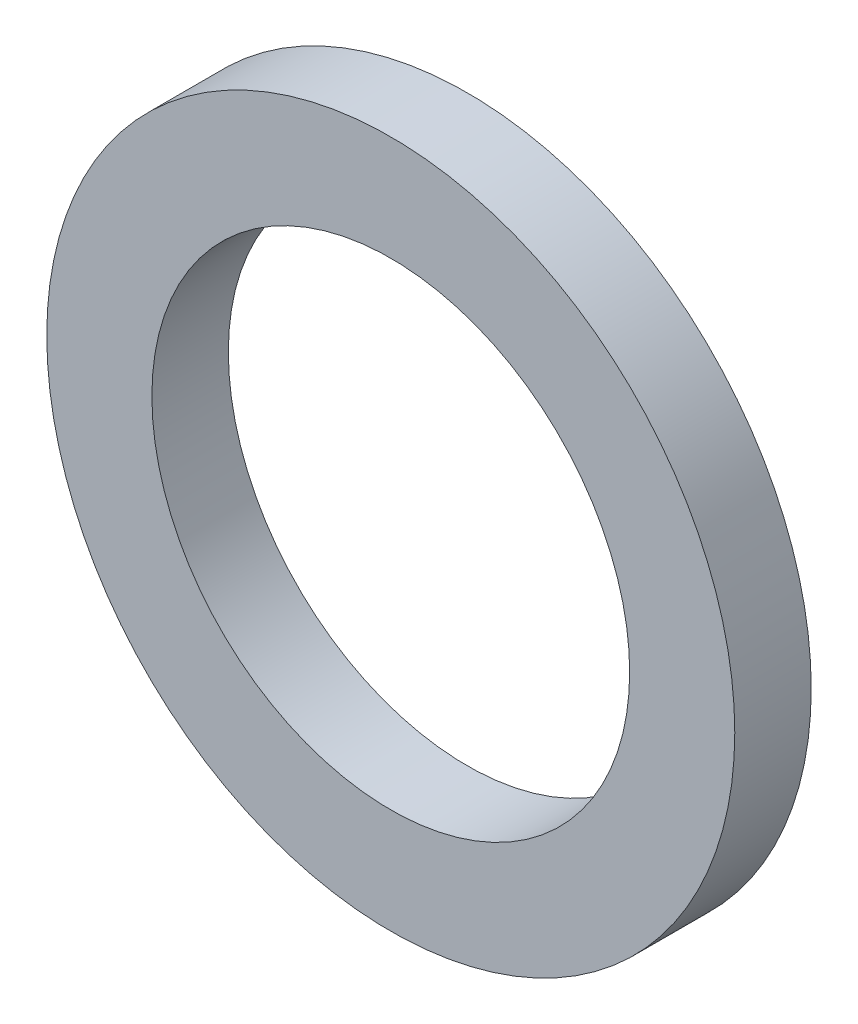
ISO-10303-21;
HEADER;
FILE_DESCRIPTION(('STEP AP214'),'2;1');
FILE_NAME('part.step','',(''),(''),'','','');
FILE_SCHEMA(('AUTOMOTIVE_DESIGN { 1 0 10303 214 1 1 1 1 }'));
ENDSEC;
DATA;
#1=APPLICATION_CONTEXT('core data for automotive mechanical design processes');
#2=APPLICATION_PROTOCOL_DEFINITION('international standard','automotive_design',2000,#1);
#3=PRODUCT_CONTEXT('',#1,'mechanical');
#4=PRODUCT('Part','Part','',(#3));
#5=PRODUCT_RELATED_PRODUCT_CATEGORY('part','',(#4));
#6=PRODUCT_DEFINITION_FORMATION('','',#4);
#7=PRODUCT_DEFINITION_CONTEXT('part definition',#1,'design');
#8=PRODUCT_DEFINITION('design','',#6,#7);
#9=PRODUCT_DEFINITION_SHAPE('','',#8);
#10=(LENGTH_UNIT() NAMED_UNIT(*) SI_UNIT(.MILLI.,.METRE.));
#11=(NAMED_UNIT(*) PLANE_ANGLE_UNIT() SI_UNIT($,.RADIAN.));
#12=(NAMED_UNIT(*) SI_UNIT($,.STERADIAN.) SOLID_ANGLE_UNIT());
#13=UNCERTAINTY_MEASURE_WITH_UNIT(LENGTH_MEASURE(1.E-05),#10,'distance_accuracy_value','');
#14=(GEOMETRIC_REPRESENTATION_CONTEXT(3) GLOBAL_UNCERTAINTY_ASSIGNED_CONTEXT((#13)) GLOBAL_UNIT_ASSIGNED_CONTEXT((#10,
#11,#12)) REPRESENTATION_CONTEXT('',''));
#15=CARTESIAN_POINT('',(0.,0.,0.));
#16=DIRECTION('',(0.,0.,1.));
#17=DIRECTION('',(1.,0.,0.));
#18=AXIS2_PLACEMENT_3D('',#15,#16,#17);
#19=CARTESIAN_POINT('',(0.,0.,4.));
#20=DIRECTION('',(0.,0.,1.));
#21=DIRECTION('',(1.,0.,0.));
#22=AXIS2_PLACEMENT_3D('',#19,#20,#21);
#23=PLANE('',#22);
#24=CARTESIAN_POINT('',(0.,0.,4.));
#25=DIRECTION('',(0.,0.,1.));
#26=DIRECTION('',(1.,0.,0.));
#27=AXIS2_PLACEMENT_3D('',#24,#25,#26);
#28=CIRCLE('',#27,18.);
#29=CARTESIAN_POINT('',(18.,0.,4.));
#30=VERTEX_POINT('',#29);
#31=EDGE_CURVE('E10',#30,#30,#28,.T.);
#32=ORIENTED_EDGE('',*,*,#31,.T.);
#33=EDGE_LOOP('',(#32));
#34=FACE_BOUND('',#33,.T.);
#35=CARTESIAN_POINT('',(0.,0.,4.));
#36=DIRECTION('',(0.,0.,1.));
#37=DIRECTION('',(1.,0.,0.));
#38=AXIS2_PLACEMENT_3D('',#35,#36,#37);
#39=CIRCLE('',#38,12.5);
#40=CARTESIAN_POINT('',(12.5,0.,4.));
#41=VERTEX_POINT('',#40);
#42=EDGE_CURVE('E50',#41,#41,#39,.T.);
#43=ORIENTED_EDGE('',*,*,#42,.F.);
#44=EDGE_LOOP('',(#43));
#45=FACE_BOUND('',#44,.T.);
#46=ADVANCED_FACE('F37',(#34,#45),#23,.T.);
#47=CARTESIAN_POINT('',(0.,0.,0.));
#48=DIRECTION('',(0.,0.,1.));
#49=DIRECTION('',(1.,0.,0.));
#50=AXIS2_PLACEMENT_3D('',#47,#48,#49);
#51=PLANE('',#50);
#52=CARTESIAN_POINT('',(0.,0.,0.));
#53=DIRECTION('',(0.,0.,1.));
#54=DIRECTION('',(1.,0.,0.));
#55=AXIS2_PLACEMENT_3D('',#52,#53,#54);
#56=CIRCLE('',#55,18.);
#57=CARTESIAN_POINT('',(18.,0.,0.));
#58=VERTEX_POINT('',#57);
#59=EDGE_CURVE('E41',#58,#58,#56,.T.);
#60=ORIENTED_EDGE('',*,*,#59,.F.);
#61=EDGE_LOOP('',(#60));
#62=FACE_BOUND('',#61,.T.);
#63=CARTESIAN_POINT('',(0.,0.,0.));
#64=DIRECTION('',(0.,0.,1.));
#65=DIRECTION('',(1.,0.,0.));
#66=AXIS2_PLACEMENT_3D('',#63,#64,#65);
#67=CIRCLE('',#66,12.5);
#68=CARTESIAN_POINT('',(12.5,0.,0.));
#69=VERTEX_POINT('',#68);
#70=EDGE_CURVE('E52',#69,#69,#67,.T.);
#71=ORIENTED_EDGE('',*,*,#70,.T.);
#72=EDGE_LOOP('',(#71));
#73=FACE_BOUND('',#72,.T.);
#74=ADVANCED_FACE('F64',(#62,#73),#51,.F.);
#75=CARTESIAN_POINT('',(0.,0.,4.));
#76=DIRECTION('',(0.,0.,-1.));
#77=DIRECTION('',(-1.,0.,0.));
#78=AXIS2_PLACEMENT_3D('',#75,#76,#77);
#79=CYLINDRICAL_SURFACE('',#78,18.);
#80=ORIENTED_EDGE('',*,*,#31,.F.);
#81=EDGE_LOOP('',(#80));
#82=FACE_BOUND('',#81,.T.);
#83=ORIENTED_EDGE('',*,*,#59,.T.);
#84=EDGE_LOOP('',(#83));
#85=FACE_BOUND('',#84,.T.);
#86=ADVANCED_FACE('F39',(#82,#85),#79,.T.);
#87=CARTESIAN_POINT('',(0.,0.,4.));
#88=DIRECTION('',(0.,0.,-1.));
#89=DIRECTION('',(-1.,0.,0.));
#90=AXIS2_PLACEMENT_3D('',#87,#88,#89);
#91=CYLINDRICAL_SURFACE('',#90,12.5);
#92=ORIENTED_EDGE('',*,*,#42,.T.);
#93=EDGE_LOOP('',(#92));
#94=FACE_BOUND('',#93,.T.);
#95=ORIENTED_EDGE('',*,*,#70,.F.);
#96=EDGE_LOOP('',(#95));
#97=FACE_BOUND('',#96,.T.);
#98=ADVANCED_FACE('F60',(#94,#97),#91,.F.);
#99=CLOSED_SHELL('',(#46,#74,#86,#98));
#100=MANIFOLD_SOLID_BREP('B2',#99);
#101=ADVANCED_BREP_SHAPE_REPRESENTATION('',(#18,#100),#14);
#102=SHAPE_DEFINITION_REPRESENTATION(#9,#101);
ENDSEC;
END-ISO-10303-21;
